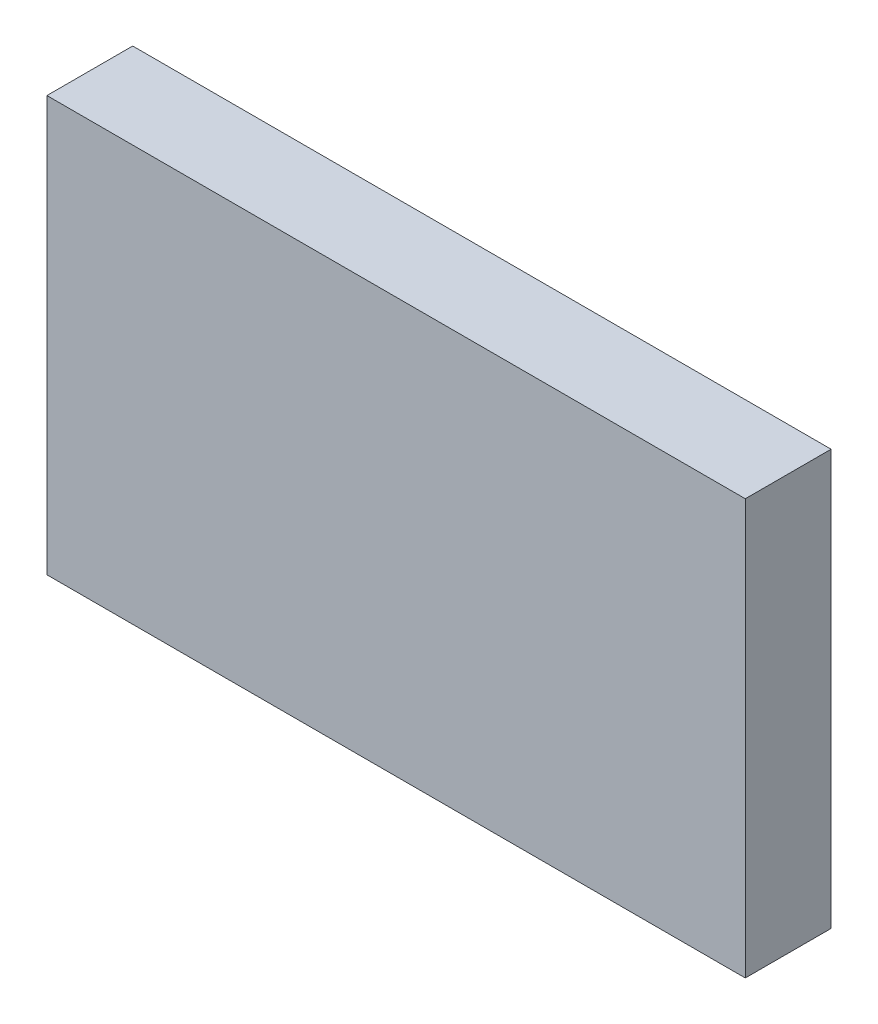
ISO-10303-21;
HEADER;
FILE_DESCRIPTION(('STEP AP214'),'2;1');
FILE_NAME('part.step','',(''),(''),'','','');
FILE_SCHEMA(('AUTOMOTIVE_DESIGN { 1 0 10303 214 1 1 1 1 }'));
ENDSEC;
DATA;
#1=APPLICATION_CONTEXT('core data for automotive mechanical design processes');
#2=APPLICATION_PROTOCOL_DEFINITION('international standard','automotive_design',2000,#1);
#3=PRODUCT_CONTEXT('',#1,'mechanical');
#4=PRODUCT('Part','Part','',(#3));
#5=PRODUCT_RELATED_PRODUCT_CATEGORY('part','',(#4));
#6=PRODUCT_DEFINITION_FORMATION('','',#4);
#7=PRODUCT_DEFINITION_CONTEXT('part definition',#1,'design');
#8=PRODUCT_DEFINITION('design','',#6,#7);
#9=PRODUCT_DEFINITION_SHAPE('','',#8);
#10=(LENGTH_UNIT() NAMED_UNIT(*) SI_UNIT(.MILLI.,.METRE.));
#11=(NAMED_UNIT(*) PLANE_ANGLE_UNIT() SI_UNIT($,.RADIAN.));
#12=(NAMED_UNIT(*) SI_UNIT($,.STERADIAN.) SOLID_ANGLE_UNIT());
#13=UNCERTAINTY_MEASURE_WITH_UNIT(LENGTH_MEASURE(1.E-05),#10,'distance_accuracy_value','');
#14=(GEOMETRIC_REPRESENTATION_CONTEXT(3) GLOBAL_UNCERTAINTY_ASSIGNED_CONTEXT((#13)) GLOBAL_UNIT_ASSIGNED_CONTEXT((#10,
#11,#12)) REPRESENTATION_CONTEXT('',''));
#15=CARTESIAN_POINT('',(0.,0.,0.));
#16=DIRECTION('',(0.,0.,1.));
#17=DIRECTION('',(1.,0.,0.));
#18=AXIS2_PLACEMENT_3D('',#15,#16,#17);
#19=CARTESIAN_POINT('',(43.3786951474148,13.3382892713671,1.6));
#20=DIRECTION('',(0.,0.,1.));
#21=DIRECTION('',(1.,0.,0.));
#22=AXIS2_PLACEMENT_3D('',#19,#20,#21);
#23=PLANE('',#22);
#24=DIRECTION('',(-1.,0.,0.));
#25=VECTOR('',#24,1.);
#26=CARTESIAN_POINT('',(45.8208565182882,11.8868793483972,1.6));
#27=LINE('',#26,#25);
#28=CARTESIAN_POINT('',(45.8208565182882,11.8868793483972,1.6));
#29=VERTEX_POINT('',#28);
#30=CARTESIAN_POINT('',(40.9365337765414,11.8868793483972,1.6));
#31=VERTEX_POINT('',#30);
#32=EDGE_CURVE('E28',#29,#31,#27,.T.);
#33=ORIENTED_EDGE('',*,*,#32,.T.);
#34=DIRECTION('',(0.,1.,0.));
#35=VECTOR('',#34,1.);
#36=CARTESIAN_POINT('',(40.9365337765414,11.8868793483972,1.6));
#37=LINE('',#36,#35);
#38=CARTESIAN_POINT('',(40.9365337765414,14.789699194337,1.6));
#39=VERTEX_POINT('',#38);
#40=EDGE_CURVE('E21',#31,#39,#37,.T.);
#41=ORIENTED_EDGE('',*,*,#40,.T.);
#42=DIRECTION('',(1.,0.,0.));
#43=VECTOR('',#42,1.);
#44=CARTESIAN_POINT('',(40.9365337765414,14.789699194337,1.6));
#45=LINE('',#44,#43);
#46=CARTESIAN_POINT('',(45.8208565182882,14.789699194337,1.6));
#47=VERTEX_POINT('',#46);
#48=EDGE_CURVE('E71',#39,#47,#45,.T.);
#49=ORIENTED_EDGE('',*,*,#48,.T.);
#50=DIRECTION('',(0.,-1.,0.));
#51=VECTOR('',#50,1.);
#52=CARTESIAN_POINT('',(45.8208565182882,14.789699194337,1.6));
#53=LINE('',#52,#51);
#54=EDGE_CURVE('E84',#47,#29,#53,.T.);
#55=ORIENTED_EDGE('',*,*,#54,.T.);
#56=EDGE_LOOP('',(#33,#41,#49,#55));
#57=FACE_BOUND('',#56,.T.);
#58=ADVANCED_FACE('F17',(#57),#23,.F.);
#59=CARTESIAN_POINT('',(43.3786951474148,13.3382892713671,2.2));
#60=DIRECTION('',(0.,0.,1.));
#61=DIRECTION('',(1.,0.,0.));
#62=AXIS2_PLACEMENT_3D('',#59,#60,#61);
#63=PLANE('',#62);
#64=DIRECTION('',(1.,0.,0.));
#65=VECTOR('',#64,1.);
#66=CARTESIAN_POINT('',(45.8208565182882,11.8868793483972,2.2));
#67=LINE('',#66,#65);
#68=CARTESIAN_POINT('',(40.9365337765414,11.8868793483972,2.2));
#69=VERTEX_POINT('',#68);
#70=CARTESIAN_POINT('',(45.8208565182882,11.8868793483972,2.2));
#71=VERTEX_POINT('',#70);
#72=EDGE_CURVE('E11',#69,#71,#67,.T.);
#73=ORIENTED_EDGE('',*,*,#72,.T.);
#74=DIRECTION('',(0.,1.,0.));
#75=VECTOR('',#74,1.);
#76=CARTESIAN_POINT('',(45.8208565182882,14.789699194337,2.2));
#77=LINE('',#76,#75);
#78=CARTESIAN_POINT('',(45.8208565182882,14.789699194337,2.2));
#79=VERTEX_POINT('',#78);
#80=EDGE_CURVE('E77',#71,#79,#77,.T.);
#81=ORIENTED_EDGE('',*,*,#80,.T.);
#82=DIRECTION('',(-1.,0.,0.));
#83=VECTOR('',#82,1.);
#84=CARTESIAN_POINT('',(40.9365337765414,14.789699194337,2.2));
#85=LINE('',#84,#83);
#86=CARTESIAN_POINT('',(40.9365337765414,14.789699194337,2.2));
#87=VERTEX_POINT('',#86);
#88=EDGE_CURVE('E52',#79,#87,#85,.T.);
#89=ORIENTED_EDGE('',*,*,#88,.T.);
#90=DIRECTION('',(0.,-1.,0.));
#91=VECTOR('',#90,1.);
#92=CARTESIAN_POINT('',(40.9365337765414,11.8868793483972,2.2));
#93=LINE('',#92,#91);
#94=EDGE_CURVE('E120',#87,#69,#93,.T.);
#95=ORIENTED_EDGE('',*,*,#94,.T.);
#96=EDGE_LOOP('',(#73,#81,#89,#95));
#97=FACE_BOUND('',#96,.T.);
#98=ADVANCED_FACE('F79',(#97),#63,.T.);
#99=CARTESIAN_POINT('',(40.9365337765414,11.8868793483972,1.6));
#100=DIRECTION('',(0.,-1.,0.));
#101=DIRECTION('',(0.,0.,-1.));
#102=AXIS2_PLACEMENT_3D('',#99,#100,#101);
#103=PLANE('',#102);
#104=ORIENTED_EDGE('',*,*,#32,.F.);
#105=DIRECTION('',(0.,0.,1.));
#106=VECTOR('',#105,1.);
#107=CARTESIAN_POINT('',(45.8208565182882,11.8868793483972,1.6));
#108=LINE('',#107,#106);
#109=EDGE_CURVE('E83',#29,#71,#108,.T.);
#110=ORIENTED_EDGE('',*,*,#109,.T.);
#111=ORIENTED_EDGE('',*,*,#72,.F.);
#112=DIRECTION('',(0.,0.,1.));
#113=VECTOR('',#112,1.);
#114=CARTESIAN_POINT('',(40.9365337765414,11.8868793483972,1.6));
#115=LINE('',#114,#113);
#116=EDGE_CURVE('E116',#31,#69,#115,.T.);
#117=ORIENTED_EDGE('',*,*,#116,.F.);
#118=EDGE_LOOP('',(#104,#110,#111,#117));
#119=FACE_BOUND('',#118,.T.);
#120=ADVANCED_FACE('F19',(#119),#103,.T.);
#121=CARTESIAN_POINT('',(45.8208565182882,11.8868793483972,1.6));
#122=DIRECTION('',(1.,0.,0.));
#123=DIRECTION('',(0.,1.,0.));
#124=AXIS2_PLACEMENT_3D('',#121,#122,#123);
#125=PLANE('',#124);
#126=ORIENTED_EDGE('',*,*,#54,.F.);
#127=DIRECTION('',(0.,0.,1.));
#128=VECTOR('',#127,1.);
#129=CARTESIAN_POINT('',(45.8208565182882,14.789699194337,1.6));
#130=LINE('',#129,#128);
#131=EDGE_CURVE('E86',#47,#79,#130,.T.);
#132=ORIENTED_EDGE('',*,*,#131,.T.);
#133=ORIENTED_EDGE('',*,*,#80,.F.);
#134=ORIENTED_EDGE('',*,*,#109,.F.);
#135=EDGE_LOOP('',(#126,#132,#133,#134));
#136=FACE_BOUND('',#135,.T.);
#137=ADVANCED_FACE('F87',(#136),#125,.T.);
#138=CARTESIAN_POINT('',(45.8208565182882,14.789699194337,1.6));
#139=DIRECTION('',(0.,1.,0.));
#140=DIRECTION('',(1.,0.,0.));
#141=AXIS2_PLACEMENT_3D('',#138,#139,#140);
#142=PLANE('',#141);
#143=ORIENTED_EDGE('',*,*,#48,.F.);
#144=DIRECTION('',(0.,0.,1.));
#145=VECTOR('',#144,1.);
#146=CARTESIAN_POINT('',(40.9365337765414,14.789699194337,1.6));
#147=LINE('',#146,#145);
#148=EDGE_CURVE('E92',#39,#87,#147,.T.);
#149=ORIENTED_EDGE('',*,*,#148,.T.);
#150=ORIENTED_EDGE('',*,*,#88,.F.);
#151=ORIENTED_EDGE('',*,*,#131,.F.);
#152=EDGE_LOOP('',(#143,#149,#150,#151));
#153=FACE_BOUND('',#152,.T.);
#154=ADVANCED_FACE('F91',(#153),#142,.T.);
#155=CARTESIAN_POINT('',(40.9365337765414,14.789699194337,1.6));
#156=DIRECTION('',(-1.,0.,0.));
#157=DIRECTION('',(0.,0.,1.));
#158=AXIS2_PLACEMENT_3D('',#155,#156,#157);
#159=PLANE('',#158);
#160=ORIENTED_EDGE('',*,*,#40,.F.);
#161=ORIENTED_EDGE('',*,*,#116,.T.);
#162=ORIENTED_EDGE('',*,*,#94,.F.);
#163=ORIENTED_EDGE('',*,*,#148,.F.);
#164=EDGE_LOOP('',(#160,#161,#162,#163));
#165=FACE_BOUND('',#164,.T.);
#166=ADVANCED_FACE('F170',(#165),#159,.T.);
#167=CLOSED_SHELL('',(#58,#98,#120,#137,#154,#166));
#168=MANIFOLD_SOLID_BREP('B1',#167);
#169=ADVANCED_BREP_SHAPE_REPRESENTATION('',(#18,#168),#14);
#170=SHAPE_DEFINITION_REPRESENTATION(#9,#169);
ENDSEC;
END-ISO-10303-21;
